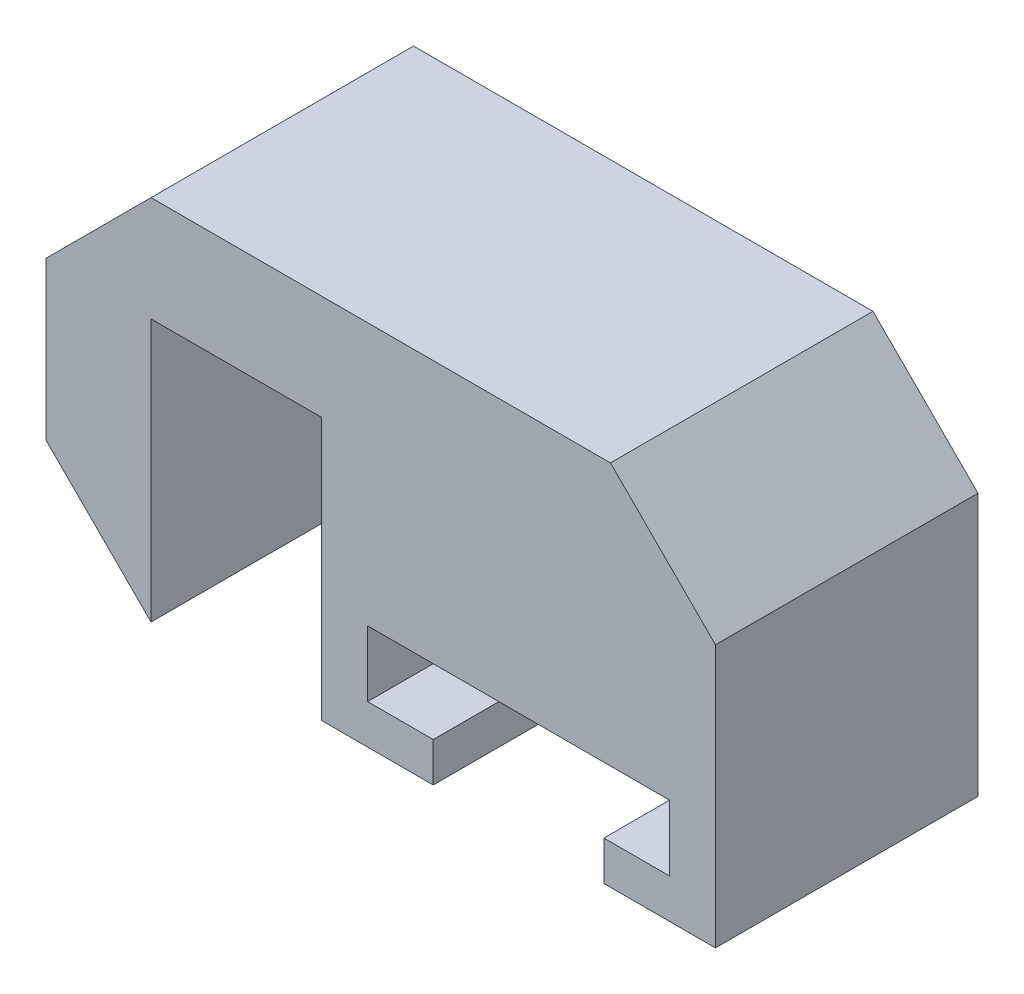
ISO-10303-21;
HEADER;
FILE_DESCRIPTION(('STEP AP214'),'2;1');
FILE_NAME('part.step','',(''),(''),'','','');
FILE_SCHEMA(('AUTOMOTIVE_DESIGN { 1 0 10303 214 1 1 1 1 }'));
ENDSEC;
DATA;
#1=APPLICATION_CONTEXT('core data for automotive mechanical design processes');
#2=APPLICATION_PROTOCOL_DEFINITION('international standard','automotive_design',2000,#1);
#3=PRODUCT_CONTEXT('',#1,'mechanical');
#4=PRODUCT('Part','Part','',(#3));
#5=PRODUCT_RELATED_PRODUCT_CATEGORY('part','',(#4));
#6=PRODUCT_DEFINITION_FORMATION('','',#4);
#7=PRODUCT_DEFINITION_CONTEXT('part definition',#1,'design');
#8=PRODUCT_DEFINITION('design','',#6,#7);
#9=PRODUCT_DEFINITION_SHAPE('','',#8);
#10=(LENGTH_UNIT() NAMED_UNIT(*) SI_UNIT(.MILLI.,.METRE.));
#11=(NAMED_UNIT(*) PLANE_ANGLE_UNIT() SI_UNIT($,.RADIAN.));
#12=(NAMED_UNIT(*) SI_UNIT($,.STERADIAN.) SOLID_ANGLE_UNIT());
#13=UNCERTAINTY_MEASURE_WITH_UNIT(LENGTH_MEASURE(1.E-05),#10,'distance_accuracy_value','');
#14=(GEOMETRIC_REPRESENTATION_CONTEXT(3) GLOBAL_UNCERTAINTY_ASSIGNED_CONTEXT((#13)) GLOBAL_UNIT_ASSIGNED_CONTEXT((#10,
#11,#12)) REPRESENTATION_CONTEXT('',''));
#15=CARTESIAN_POINT('',(0.,0.,0.));
#16=DIRECTION('',(0.,0.,1.));
#17=DIRECTION('',(1.,0.,0.));
#18=AXIS2_PLACEMENT_3D('',#15,#16,#17);
#19=CARTESIAN_POINT('',(0.,0.,10.));
#20=DIRECTION('',(0.,1.,0.));
#21=DIRECTION('',(0.,0.,1.));
#22=AXIS2_PLACEMENT_3D('',#19,#20,#21);
#23=PLANE('',#22);
#24=DIRECTION('',(1.,0.,0.));
#25=VECTOR('',#24,1.);
#26=CARTESIAN_POINT('',(0.,0.,0.));
#27=LINE('',#26,#25);
#28=CARTESIAN_POINT('',(0.,0.,0.));
#29=VERTEX_POINT('',#28);
#30=CARTESIAN_POINT('',(4.25,0.,0.));
#31=VERTEX_POINT('',#30);
#32=EDGE_CURVE('E195',#29,#31,#27,.T.);
#33=ORIENTED_EDGE('',*,*,#32,.T.);
#34=DIRECTION('',(0.,0.,1.));
#35=VECTOR('',#34,1.);
#36=CARTESIAN_POINT('',(4.25,0.,0.));
#37=LINE('',#36,#35);
#38=CARTESIAN_POINT('',(4.25,0.,10.));
#39=VERTEX_POINT('',#38);
#40=EDGE_CURVE('E202',#31,#39,#37,.T.);
#41=ORIENTED_EDGE('',*,*,#40,.T.);
#42=DIRECTION('',(1.,0.,0.));
#43=VECTOR('',#42,1.);
#44=CARTESIAN_POINT('',(0.,0.,10.));
#45=LINE('',#44,#43);
#46=CARTESIAN_POINT('',(0.,0.,10.));
#47=VERTEX_POINT('',#46);
#48=EDGE_CURVE('E286',#47,#39,#45,.T.);
#49=ORIENTED_EDGE('',*,*,#48,.F.);
#50=DIRECTION('',(0.,0.,-1.));
#51=VECTOR('',#50,1.);
#52=CARTESIAN_POINT('',(0.,0.,10.));
#53=LINE('',#52,#51);
#54=EDGE_CURVE('E238',#47,#29,#53,.T.);
#55=ORIENTED_EDGE('',*,*,#54,.T.);
#56=EDGE_LOOP('',(#33,#41,#49,#55));
#57=FACE_BOUND('',#56,.T.);
#58=ADVANCED_FACE('F41',(#57),#23,.F.);
#59=CARTESIAN_POINT('',(0.,10.,10.));
#60=DIRECTION('',(1.,0.,0.));
#61=DIRECTION('',(0.,0.,-1.));
#62=AXIS2_PLACEMENT_3D('',#59,#60,#61);
#63=PLANE('',#62);
#64=DIRECTION('',(0.,-1.,0.));
#65=VECTOR('',#64,1.);
#66=CARTESIAN_POINT('',(0.,10.,0.));
#67=LINE('',#66,#65);
#68=CARTESIAN_POINT('',(0.,10.,0.));
#69=VERTEX_POINT('',#68);
#70=EDGE_CURVE('E196',#69,#29,#67,.T.);
#71=ORIENTED_EDGE('',*,*,#70,.T.);
#72=ORIENTED_EDGE('',*,*,#54,.F.);
#73=DIRECTION('',(0.,-1.,0.));
#74=VECTOR('',#73,1.);
#75=CARTESIAN_POINT('',(0.,10.,10.));
#76=LINE('',#75,#74);
#77=CARTESIAN_POINT('',(0.,10.,10.));
#78=VERTEX_POINT('',#77);
#79=EDGE_CURVE('E221',#78,#47,#76,.T.);
#80=ORIENTED_EDGE('',*,*,#79,.F.);
#81=DIRECTION('',(0.,0.,-1.));
#82=VECTOR('',#81,1.);
#83=CARTESIAN_POINT('',(0.,10.,10.));
#84=LINE('',#83,#82);
#85=EDGE_CURVE('E222',#78,#69,#84,.T.);
#86=ORIENTED_EDGE('',*,*,#85,.T.);
#87=EDGE_LOOP('',(#71,#72,#80,#86));
#88=FACE_BOUND('',#87,.T.);
#89=ADVANCED_FACE('F395',(#88),#63,.F.);
#90=CARTESIAN_POINT('',(10.75,0.,10.));
#91=VERTEX_POINT('',#90);
#92=CARTESIAN_POINT('',(15.,0.,10.));
#93=VERTEX_POINT('',#92);
#94=EDGE_CURVE('E185',#91,#93,#45,.T.);
#95=ORIENTED_EDGE('',*,*,#94,.F.);
#96=DIRECTION('',(0.,0.,1.));
#97=VECTOR('',#96,1.);
#98=CARTESIAN_POINT('',(10.75,0.,0.));
#99=LINE('',#98,#97);
#100=CARTESIAN_POINT('',(10.75,0.,0.));
#101=VERTEX_POINT('',#100);
#102=EDGE_CURVE('E171',#101,#91,#99,.T.);
#103=ORIENTED_EDGE('',*,*,#102,.F.);
#104=CARTESIAN_POINT('',(15.,0.,0.));
#105=VERTEX_POINT('',#104);
#106=EDGE_CURVE('E183',#101,#105,#27,.T.);
#107=ORIENTED_EDGE('',*,*,#106,.T.);
#108=DIRECTION('',(0.,0.,-1.));
#109=VECTOR('',#108,1.);
#110=CARTESIAN_POINT('',(15.,0.,10.));
#111=LINE('',#110,#109);
#112=EDGE_CURVE('E235',#93,#105,#111,.T.);
#113=ORIENTED_EDGE('',*,*,#112,.F.);
#114=EDGE_LOOP('',(#95,#103,#107,#113));
#115=FACE_BOUND('',#114,.T.);
#116=ADVANCED_FACE('F181',(#115),#23,.F.);
#117=CARTESIAN_POINT('',(15.,0.,10.));
#118=DIRECTION('',(-1.,0.,0.));
#119=DIRECTION('',(0.,0.,1.));
#120=AXIS2_PLACEMENT_3D('',#117,#118,#119);
#121=PLANE('',#120);
#122=DIRECTION('',(0.,1.,0.));
#123=VECTOR('',#122,1.);
#124=CARTESIAN_POINT('',(15.,0.,0.));
#125=LINE('',#124,#123);
#126=CARTESIAN_POINT('',(15.,9.99999999999999,0.));
#127=VERTEX_POINT('',#126);
#128=EDGE_CURVE('E193',#105,#127,#125,.T.);
#129=ORIENTED_EDGE('',*,*,#128,.T.);
#130=DIRECTION('',(0.,0.,1.));
#131=VECTOR('',#130,1.);
#132=CARTESIAN_POINT('',(15.,9.99999999999999,10.));
#133=LINE('',#132,#131);
#134=CARTESIAN_POINT('',(15.,9.99999999999999,10.));
#135=VERTEX_POINT('',#134);
#136=EDGE_CURVE('E11',#127,#135,#133,.T.);
#137=ORIENTED_EDGE('',*,*,#136,.T.);
#138=DIRECTION('',(0.,1.,0.));
#139=VECTOR('',#138,1.);
#140=CARTESIAN_POINT('',(15.,0.,10.));
#141=LINE('',#140,#139);
#142=EDGE_CURVE('E282',#93,#135,#141,.T.);
#143=ORIENTED_EDGE('',*,*,#142,.F.);
#144=ORIENTED_EDGE('',*,*,#112,.T.);
#145=EDGE_LOOP('',(#129,#137,#143,#144));
#146=FACE_BOUND('',#145,.T.);
#147=ADVANCED_FACE('F404',(#146),#121,.F.);
#148=CARTESIAN_POINT('',(15.,14.,10.));
#149=DIRECTION('',(0.,-1.,0.));
#150=DIRECTION('',(1.,0.,0.));
#151=AXIS2_PLACEMENT_3D('',#148,#149,#150);
#152=PLANE('',#151);
#153=DIRECTION('',(-1.,0.,0.));
#154=VECTOR('',#153,1.);
#155=CARTESIAN_POINT('',(15.,14.,0.));
#156=LINE('',#155,#154);
#157=CARTESIAN_POINT('',(11.,14.,0.));
#158=VERTEX_POINT('',#157);
#159=CARTESIAN_POINT('',(-6.49999999999998,14.,0.));
#160=VERTEX_POINT('',#159);
#161=EDGE_CURVE('E208',#158,#160,#156,.T.);
#162=ORIENTED_EDGE('',*,*,#161,.T.);
#163=DIRECTION('',(0.,0.,1.));
#164=VECTOR('',#163,1.);
#165=CARTESIAN_POINT('',(-6.49999999999998,14.,10.));
#166=LINE('',#165,#164);
#167=CARTESIAN_POINT('',(-6.49999999999998,14.,10.));
#168=VERTEX_POINT('',#167);
#169=EDGE_CURVE('E51',#160,#168,#166,.T.);
#170=ORIENTED_EDGE('',*,*,#169,.T.);
#171=DIRECTION('',(-1.,0.,0.));
#172=VECTOR('',#171,1.);
#173=CARTESIAN_POINT('',(15.,14.,10.));
#174=LINE('',#173,#172);
#175=CARTESIAN_POINT('',(11.,14.,10.));
#176=VERTEX_POINT('',#175);
#177=EDGE_CURVE('E279',#176,#168,#174,.T.);
#178=ORIENTED_EDGE('',*,*,#177,.F.);
#179=DIRECTION('',(0.,0.,-1.));
#180=VECTOR('',#179,1.);
#181=CARTESIAN_POINT('',(11.,14.,10.));
#182=LINE('',#181,#180);
#183=EDGE_CURVE('E267',#176,#158,#182,.T.);
#184=ORIENTED_EDGE('',*,*,#183,.T.);
#185=EDGE_LOOP('',(#162,#170,#178,#184));
#186=FACE_BOUND('',#185,.T.);
#187=ADVANCED_FACE('F408',(#186),#152,.F.);
#188=CARTESIAN_POINT('',(-10.5,14.,10.));
#189=DIRECTION('',(1.,0.,0.));
#190=DIRECTION('',(0.,1.,0.));
#191=AXIS2_PLACEMENT_3D('',#188,#189,#190);
#192=PLANE('',#191);
#193=DIRECTION('',(0.,-1.,0.));
#194=VECTOR('',#193,1.);
#195=CARTESIAN_POINT('',(-10.5,14.,0.));
#196=LINE('',#195,#194);
#197=CARTESIAN_POINT('',(-10.5,9.99999999999999,0.));
#198=VERTEX_POINT('',#197);
#199=CARTESIAN_POINT('',(-10.5,4.00000000000001,0.));
#200=VERTEX_POINT('',#199);
#201=EDGE_CURVE('E211',#198,#200,#196,.T.);
#202=ORIENTED_EDGE('',*,*,#201,.T.);
#203=DIRECTION('',(0.,0.,1.));
#204=VECTOR('',#203,1.);
#205=CARTESIAN_POINT('',(-10.5,4.00000000000001,10.));
#206=LINE('',#205,#204);
#207=CARTESIAN_POINT('',(-10.5,4.00000000000001,10.));
#208=VERTEX_POINT('',#207);
#209=EDGE_CURVE('E255',#200,#208,#206,.T.);
#210=ORIENTED_EDGE('',*,*,#209,.T.);
#211=DIRECTION('',(0.,-1.,0.));
#212=VECTOR('',#211,1.);
#213=CARTESIAN_POINT('',(-10.5,14.,10.));
#214=LINE('',#213,#212);
#215=CARTESIAN_POINT('',(-10.5,9.99999999999999,10.));
#216=VERTEX_POINT('',#215);
#217=EDGE_CURVE('E275',#216,#208,#214,.T.);
#218=ORIENTED_EDGE('',*,*,#217,.F.);
#219=DIRECTION('',(0.,0.,-1.));
#220=VECTOR('',#219,1.);
#221=CARTESIAN_POINT('',(-10.5,9.99999999999999,10.));
#222=LINE('',#221,#220);
#223=EDGE_CURVE('E251',#216,#198,#222,.T.);
#224=ORIENTED_EDGE('',*,*,#223,.T.);
#225=EDGE_LOOP('',(#202,#210,#218,#224));
#226=FACE_BOUND('',#225,.T.);
#227=ADVANCED_FACE('F413',(#226),#192,.F.);
#228=CARTESIAN_POINT('',(-6.5,0.,10.));
#229=DIRECTION('',(-1.,0.,0.));
#230=DIRECTION('',(0.,-1.,0.));
#231=AXIS2_PLACEMENT_3D('',#228,#229,#230);
#232=PLANE('',#231);
#233=DIRECTION('',(0.,1.,0.));
#234=VECTOR('',#233,1.);
#235=CARTESIAN_POINT('',(-6.5,0.,0.));
#236=LINE('',#235,#234);
#237=CARTESIAN_POINT('',(-6.5,0.,0.));
#238=VERTEX_POINT('',#237);
#239=CARTESIAN_POINT('',(-6.5,10.,0.));
#240=VERTEX_POINT('',#239);
#241=EDGE_CURVE('E215',#238,#240,#236,.T.);
#242=ORIENTED_EDGE('',*,*,#241,.T.);
#243=DIRECTION('',(0.,0.,-1.));
#244=VECTOR('',#243,1.);
#245=CARTESIAN_POINT('',(-6.5,10.,10.));
#246=LINE('',#245,#244);
#247=CARTESIAN_POINT('',(-6.5,10.,10.));
#248=VERTEX_POINT('',#247);
#249=EDGE_CURVE('E226',#248,#240,#246,.T.);
#250=ORIENTED_EDGE('',*,*,#249,.F.);
#251=DIRECTION('',(0.,1.,0.));
#252=VECTOR('',#251,1.);
#253=CARTESIAN_POINT('',(-6.5,0.,10.));
#254=LINE('',#253,#252);
#255=CARTESIAN_POINT('',(-6.5,0.,10.));
#256=VERTEX_POINT('',#255);
#257=EDGE_CURVE('E273',#256,#248,#254,.T.);
#258=ORIENTED_EDGE('',*,*,#257,.F.);
#259=DIRECTION('',(0.,0.,-1.));
#260=VECTOR('',#259,1.);
#261=CARTESIAN_POINT('',(-6.5,0.,10.));
#262=LINE('',#261,#260);
#263=EDGE_CURVE('E231',#256,#238,#262,.T.);
#264=ORIENTED_EDGE('',*,*,#263,.T.);
#265=EDGE_LOOP('',(#242,#250,#258,#264));
#266=FACE_BOUND('',#265,.T.);
#267=ADVANCED_FACE('F418',(#266),#232,.F.);
#268=CARTESIAN_POINT('',(-6.5,10.,10.));
#269=DIRECTION('',(0.,1.,0.));
#270=DIRECTION('',(0.,0.,1.));
#271=AXIS2_PLACEMENT_3D('',#268,#269,#270);
#272=PLANE('',#271);
#273=DIRECTION('',(1.,0.,0.));
#274=VECTOR('',#273,1.);
#275=CARTESIAN_POINT('',(-6.5,10.,0.));
#276=LINE('',#275,#274);
#277=EDGE_CURVE('E218',#240,#69,#276,.T.);
#278=ORIENTED_EDGE('',*,*,#277,.T.);
#279=ORIENTED_EDGE('',*,*,#85,.F.);
#280=DIRECTION('',(1.,0.,0.));
#281=VECTOR('',#280,1.);
#282=CARTESIAN_POINT('',(-6.5,10.,10.));
#283=LINE('',#282,#281);
#284=EDGE_CURVE('E227',#248,#78,#283,.T.);
#285=ORIENTED_EDGE('',*,*,#284,.F.);
#286=ORIENTED_EDGE('',*,*,#249,.T.);
#287=EDGE_LOOP('',(#278,#279,#285,#286));
#288=FACE_BOUND('',#287,.T.);
#289=ADVANCED_FACE('F422',(#288),#272,.F.);
#290=CARTESIAN_POINT('',(0.,0.,10.));
#291=DIRECTION('',(0.,0.,1.));
#292=DIRECTION('',(1.,0.,0.));
#293=AXIS2_PLACEMENT_3D('',#290,#291,#292);
#294=PLANE('',#293);
#295=DIRECTION('',(0.,-1.,0.));
#296=VECTOR('',#295,1.);
#297=CARTESIAN_POINT('',(4.25,0.,10.));
#298=LINE('',#297,#296);
#299=CARTESIAN_POINT('',(4.25,1.5,10.));
#300=VERTEX_POINT('',#299);
#301=EDGE_CURVE('E177',#300,#39,#298,.T.);
#302=ORIENTED_EDGE('',*,*,#301,.F.);
#303=DIRECTION('',(1.,0.,0.));
#304=VECTOR('',#303,1.);
#305=CARTESIAN_POINT('',(4.25,1.5,10.));
#306=LINE('',#305,#304);
#307=CARTESIAN_POINT('',(1.75,1.5,10.));
#308=VERTEX_POINT('',#307);
#309=EDGE_CURVE('E320',#308,#300,#306,.T.);
#310=ORIENTED_EDGE('',*,*,#309,.F.);
#311=DIRECTION('',(0.,-1.,0.));
#312=VECTOR('',#311,1.);
#313=CARTESIAN_POINT('',(1.75,1.5,10.));
#314=LINE('',#313,#312);
#315=CARTESIAN_POINT('',(1.75,4.,10.));
#316=VERTEX_POINT('',#315);
#317=EDGE_CURVE('E324',#316,#308,#314,.T.);
#318=ORIENTED_EDGE('',*,*,#317,.F.);
#319=DIRECTION('',(-1.,0.,0.));
#320=VECTOR('',#319,1.);
#321=CARTESIAN_POINT('',(1.75,4.,10.));
#322=LINE('',#321,#320);
#323=CARTESIAN_POINT('',(13.25,4.,10.));
#324=VERTEX_POINT('',#323);
#325=EDGE_CURVE('E328',#324,#316,#322,.T.);
#326=ORIENTED_EDGE('',*,*,#325,.F.);
#327=DIRECTION('',(0.,1.,0.));
#328=VECTOR('',#327,1.);
#329=CARTESIAN_POINT('',(13.25,4.,10.));
#330=LINE('',#329,#328);
#331=CARTESIAN_POINT('',(13.25,1.5,10.));
#332=VERTEX_POINT('',#331);
#333=EDGE_CURVE('E332',#332,#324,#330,.T.);
#334=ORIENTED_EDGE('',*,*,#333,.F.);
#335=DIRECTION('',(1.,0.,0.));
#336=VECTOR('',#335,1.);
#337=CARTESIAN_POINT('',(13.25,1.5,10.));
#338=LINE('',#337,#336);
#339=CARTESIAN_POINT('',(10.75,1.5,10.));
#340=VERTEX_POINT('',#339);
#341=EDGE_CURVE('E336',#340,#332,#338,.T.);
#342=ORIENTED_EDGE('',*,*,#341,.F.);
#343=DIRECTION('',(0.,1.,0.));
#344=VECTOR('',#343,1.);
#345=CARTESIAN_POINT('',(10.75,1.5,10.));
#346=LINE('',#345,#344);
#347=EDGE_CURVE('E340',#91,#340,#346,.T.);
#348=ORIENTED_EDGE('',*,*,#347,.F.);
#349=ORIENTED_EDGE('',*,*,#94,.T.);
#350=ORIENTED_EDGE('',*,*,#142,.T.);
#351=DIRECTION('',(0.707106781186547,-0.707106781186549,0.));
#352=VECTOR('',#351,1.);
#353=CARTESIAN_POINT('',(12.5,12.5,10.));
#354=LINE('',#353,#352);
#355=EDGE_CURVE('E258',#135,#176,#354,.F.);
#356=ORIENTED_EDGE('',*,*,#355,.T.);
#357=ORIENTED_EDGE('',*,*,#177,.T.);
#358=DIRECTION('',(0.707106781186549,0.707106781186546,0.));
#359=VECTOR('',#358,1.);
#360=CARTESIAN_POINT('',(-10.25,10.25,10.));
#361=LINE('',#360,#359);
#362=EDGE_CURVE('E261',#168,#216,#361,.F.);
#363=ORIENTED_EDGE('',*,*,#362,.T.);
#364=ORIENTED_EDGE('',*,*,#217,.T.);
#365=DIRECTION('',(-0.707106781186547,0.707106781186549,0.));
#366=VECTOR('',#365,1.);
#367=CARTESIAN_POINT('',(-3.25000000000001,-3.25,10.));
#368=LINE('',#367,#366);
#369=EDGE_CURVE('E264',#208,#256,#368,.F.);
#370=ORIENTED_EDGE('',*,*,#369,.T.);
#371=ORIENTED_EDGE('',*,*,#257,.T.);
#372=ORIENTED_EDGE('',*,*,#284,.T.);
#373=ORIENTED_EDGE('',*,*,#79,.T.);
#374=ORIENTED_EDGE('',*,*,#48,.T.);
#375=EDGE_LOOP('',(#302,#310,#318,#326,#334,#342,#348,#349,#350,#356,#357,#363,#364,#370,#371,
#372,#373,#374));
#376=FACE_BOUND('',#375,.T.);
#377=ADVANCED_FACE('F383',(#376),#294,.T.);
#378=CARTESIAN_POINT('',(0.,0.,0.));
#379=DIRECTION('',(0.,0.,1.));
#380=DIRECTION('',(1.,0.,0.));
#381=AXIS2_PLACEMENT_3D('',#378,#379,#380);
#382=PLANE('',#381);
#383=DIRECTION('',(1.,0.,0.));
#384=VECTOR('',#383,1.);
#385=CARTESIAN_POINT('',(4.25,1.5,0.));
#386=LINE('',#385,#384);
#387=CARTESIAN_POINT('',(1.75,1.5,0.));
#388=VERTEX_POINT('',#387);
#389=CARTESIAN_POINT('',(4.25,1.5,0.));
#390=VERTEX_POINT('',#389);
#391=EDGE_CURVE('E346',#388,#390,#386,.T.);
#392=ORIENTED_EDGE('',*,*,#391,.T.);
#393=DIRECTION('',(0.,-1.,0.));
#394=VECTOR('',#393,1.);
#395=CARTESIAN_POINT('',(4.25,0.,0.));
#396=LINE('',#395,#394);
#397=EDGE_CURVE('E187',#390,#31,#396,.T.);
#398=ORIENTED_EDGE('',*,*,#397,.T.);
#399=ORIENTED_EDGE('',*,*,#32,.F.);
#400=ORIENTED_EDGE('',*,*,#70,.F.);
#401=ORIENTED_EDGE('',*,*,#277,.F.);
#402=ORIENTED_EDGE('',*,*,#241,.F.);
#403=DIRECTION('',(0.707106781186547,-0.707106781186549,0.));
#404=VECTOR('',#403,1.);
#405=CARTESIAN_POINT('',(-6.5,0.,0.));
#406=LINE('',#405,#404);
#407=EDGE_CURVE('E248',#238,#200,#406,.F.);
#408=ORIENTED_EDGE('',*,*,#407,.T.);
#409=ORIENTED_EDGE('',*,*,#201,.F.);
#410=DIRECTION('',(-0.707106781186549,-0.707106781186546,0.));
#411=VECTOR('',#410,1.);
#412=CARTESIAN_POINT('',(-10.5,9.99999999999999,0.));
#413=LINE('',#412,#411);
#414=EDGE_CURVE('E245',#198,#160,#413,.F.);
#415=ORIENTED_EDGE('',*,*,#414,.T.);
#416=ORIENTED_EDGE('',*,*,#161,.F.);
#417=DIRECTION('',(-0.707106781186547,0.707106781186549,0.));
#418=VECTOR('',#417,1.);
#419=CARTESIAN_POINT('',(11.,14.,0.));
#420=LINE('',#419,#418);
#421=EDGE_CURVE('E242',#158,#127,#420,.F.);
#422=ORIENTED_EDGE('',*,*,#421,.T.);
#423=ORIENTED_EDGE('',*,*,#128,.F.);
#424=ORIENTED_EDGE('',*,*,#106,.F.);
#425=DIRECTION('',(0.,1.,0.));
#426=VECTOR('',#425,1.);
#427=CARTESIAN_POINT('',(10.75,1.5,0.));
#428=LINE('',#427,#426);
#429=CARTESIAN_POINT('',(10.75,1.5,0.));
#430=VERTEX_POINT('',#429);
#431=EDGE_CURVE('E167',#101,#430,#428,.T.);
#432=ORIENTED_EDGE('',*,*,#431,.T.);
#433=DIRECTION('',(1.,0.,0.));
#434=VECTOR('',#433,1.);
#435=CARTESIAN_POINT('',(13.25,1.5,0.));
#436=LINE('',#435,#434);
#437=CARTESIAN_POINT('',(13.25,1.5,0.));
#438=VERTEX_POINT('',#437);
#439=EDGE_CURVE('E58',#430,#438,#436,.T.);
#440=ORIENTED_EDGE('',*,*,#439,.T.);
#441=DIRECTION('',(0.,1.,0.));
#442=VECTOR('',#441,1.);
#443=CARTESIAN_POINT('',(13.25,4.,0.));
#444=LINE('',#443,#442);
#445=CARTESIAN_POINT('',(13.25,4.,0.));
#446=VERTEX_POINT('',#445);
#447=EDGE_CURVE('E357',#438,#446,#444,.T.);
#448=ORIENTED_EDGE('',*,*,#447,.T.);
#449=DIRECTION('',(-1.,0.,0.));
#450=VECTOR('',#449,1.);
#451=CARTESIAN_POINT('',(1.75,4.,0.));
#452=LINE('',#451,#450);
#453=CARTESIAN_POINT('',(1.75,4.,0.));
#454=VERTEX_POINT('',#453);
#455=EDGE_CURVE('E353',#446,#454,#452,.T.);
#456=ORIENTED_EDGE('',*,*,#455,.T.);
#457=DIRECTION('',(0.,-1.,0.));
#458=VECTOR('',#457,1.);
#459=CARTESIAN_POINT('',(1.75,1.5,0.));
#460=LINE('',#459,#458);
#461=EDGE_CURVE('E349',#454,#388,#460,.T.);
#462=ORIENTED_EDGE('',*,*,#461,.T.);
#463=EDGE_LOOP('',(#392,#398,#399,#400,#401,#402,#408,#409,#415,#416,#422,#423,#424,#432,#440,
#448,#456,#462));
#464=FACE_BOUND('',#463,.T.);
#465=ADVANCED_FACE('F191',(#464),#382,.F.);
#466=CARTESIAN_POINT('',(-6.5,0.,10.));
#467=DIRECTION('',(0.707106781186548,0.707106781186546,0.));
#468=DIRECTION('',(0.,0.,-1.));
#469=AXIS2_PLACEMENT_3D('',#466,#467,#468);
#470=PLANE('',#469);
#471=ORIENTED_EDGE('',*,*,#369,.F.);
#472=ORIENTED_EDGE('',*,*,#209,.F.);
#473=ORIENTED_EDGE('',*,*,#407,.F.);
#474=ORIENTED_EDGE('',*,*,#263,.F.);
#475=EDGE_LOOP('',(#471,#472,#473,#474));
#476=FACE_BOUND('',#475,.T.);
#477=ADVANCED_FACE('F429',(#476),#470,.F.);
#478=CARTESIAN_POINT('',(-10.5,9.99999999999999,10.));
#479=DIRECTION('',(0.707106781186546,-0.707106781186549,0.));
#480=DIRECTION('',(0.,0.,-1.));
#481=AXIS2_PLACEMENT_3D('',#478,#479,#480);
#482=PLANE('',#481);
#483=ORIENTED_EDGE('',*,*,#362,.F.);
#484=ORIENTED_EDGE('',*,*,#169,.F.);
#485=ORIENTED_EDGE('',*,*,#414,.F.);
#486=ORIENTED_EDGE('',*,*,#223,.F.);
#487=EDGE_LOOP('',(#483,#484,#485,#486));
#488=FACE_BOUND('',#487,.T.);
#489=ADVANCED_FACE('F446',(#488),#482,.F.);
#490=CARTESIAN_POINT('',(11.,14.,10.));
#491=DIRECTION('',(-0.707106781186549,-0.707106781186547,0.));
#492=DIRECTION('',(0.,0.,-1.));
#493=AXIS2_PLACEMENT_3D('',#490,#491,#492);
#494=PLANE('',#493);
#495=ORIENTED_EDGE('',*,*,#355,.F.);
#496=ORIENTED_EDGE('',*,*,#136,.F.);
#497=ORIENTED_EDGE('',*,*,#421,.F.);
#498=ORIENTED_EDGE('',*,*,#183,.F.);
#499=EDGE_LOOP('',(#495,#496,#497,#498));
#500=FACE_BOUND('',#499,.T.);
#501=ADVANCED_FACE('F44',(#500),#494,.F.);
#502=CARTESIAN_POINT('',(4.25,0.,0.));
#503=DIRECTION('',(-1.,0.,0.));
#504=DIRECTION('',(0.,-1.,0.));
#505=AXIS2_PLACEMENT_3D('',#502,#503,#504);
#506=PLANE('',#505);
#507=ORIENTED_EDGE('',*,*,#301,.T.);
#508=ORIENTED_EDGE('',*,*,#40,.F.);
#509=ORIENTED_EDGE('',*,*,#397,.F.);
#510=DIRECTION('',(0.,0.,1.));
#511=VECTOR('',#510,1.);
#512=CARTESIAN_POINT('',(4.25,1.5,0.));
#513=LINE('',#512,#511);
#514=EDGE_CURVE('E312',#390,#300,#513,.T.);
#515=ORIENTED_EDGE('',*,*,#514,.T.);
#516=EDGE_LOOP('',(#507,#508,#509,#515));
#517=FACE_BOUND('',#516,.T.);
#518=ADVANCED_FACE('F381',(#517),#506,.F.);
#519=CARTESIAN_POINT('',(4.25,1.5,0.));
#520=DIRECTION('',(0.,-1.,0.));
#521=DIRECTION('',(1.,0.,0.));
#522=AXIS2_PLACEMENT_3D('',#519,#520,#521);
#523=PLANE('',#522);
#524=ORIENTED_EDGE('',*,*,#309,.T.);
#525=ORIENTED_EDGE('',*,*,#514,.F.);
#526=ORIENTED_EDGE('',*,*,#391,.F.);
#527=DIRECTION('',(0.,0.,1.));
#528=VECTOR('',#527,1.);
#529=CARTESIAN_POINT('',(1.75,1.5,0.));
#530=LINE('',#529,#528);
#531=EDGE_CURVE('E309',#388,#308,#530,.T.);
#532=ORIENTED_EDGE('',*,*,#531,.T.);
#533=EDGE_LOOP('',(#524,#525,#526,#532));
#534=FACE_BOUND('',#533,.T.);
#535=ADVANCED_FACE('F377',(#534),#523,.F.);
#536=CARTESIAN_POINT('',(1.75,1.5,0.));
#537=DIRECTION('',(-1.,0.,0.));
#538=DIRECTION('',(0.,0.,1.));
#539=AXIS2_PLACEMENT_3D('',#536,#537,#538);
#540=PLANE('',#539);
#541=ORIENTED_EDGE('',*,*,#317,.T.);
#542=ORIENTED_EDGE('',*,*,#531,.F.);
#543=ORIENTED_EDGE('',*,*,#461,.F.);
#544=DIRECTION('',(0.,0.,1.));
#545=VECTOR('',#544,1.);
#546=CARTESIAN_POINT('',(1.75,4.,0.));
#547=LINE('',#546,#545);
#548=EDGE_CURVE('E306',#454,#316,#547,.T.);
#549=ORIENTED_EDGE('',*,*,#548,.T.);
#550=EDGE_LOOP('',(#541,#542,#543,#549));
#551=FACE_BOUND('',#550,.T.);
#552=ADVANCED_FACE('F373',(#551),#540,.F.);
#553=CARTESIAN_POINT('',(1.75,4.,0.));
#554=DIRECTION('',(0.,1.,0.));
#555=DIRECTION('',(-1.,0.,0.));
#556=AXIS2_PLACEMENT_3D('',#553,#554,#555);
#557=PLANE('',#556);
#558=ORIENTED_EDGE('',*,*,#325,.T.);
#559=ORIENTED_EDGE('',*,*,#548,.F.);
#560=ORIENTED_EDGE('',*,*,#455,.F.);
#561=DIRECTION('',(0.,0.,1.));
#562=VECTOR('',#561,1.);
#563=CARTESIAN_POINT('',(13.25,4.,0.));
#564=LINE('',#563,#562);
#565=EDGE_CURVE('E303',#446,#324,#564,.T.);
#566=ORIENTED_EDGE('',*,*,#565,.T.);
#567=EDGE_LOOP('',(#558,#559,#560,#566));
#568=FACE_BOUND('',#567,.T.);
#569=ADVANCED_FACE('F369',(#568),#557,.F.);
#570=CARTESIAN_POINT('',(13.25,4.,0.));
#571=DIRECTION('',(1.,0.,0.));
#572=DIRECTION('',(0.,0.,-1.));
#573=AXIS2_PLACEMENT_3D('',#570,#571,#572);
#574=PLANE('',#573);
#575=ORIENTED_EDGE('',*,*,#333,.T.);
#576=ORIENTED_EDGE('',*,*,#565,.F.);
#577=ORIENTED_EDGE('',*,*,#447,.F.);
#578=DIRECTION('',(0.,0.,1.));
#579=VECTOR('',#578,1.);
#580=CARTESIAN_POINT('',(13.25,1.5,0.));
#581=LINE('',#580,#579);
#582=EDGE_CURVE('E300',#438,#332,#581,.T.);
#583=ORIENTED_EDGE('',*,*,#582,.T.);
#584=EDGE_LOOP('',(#575,#576,#577,#583));
#585=FACE_BOUND('',#584,.T.);
#586=ADVANCED_FACE('F365',(#585),#574,.F.);
#587=CARTESIAN_POINT('',(13.25,1.5,0.));
#588=DIRECTION('',(0.,-1.,0.));
#589=DIRECTION('',(0.,0.,-1.));
#590=AXIS2_PLACEMENT_3D('',#587,#588,#589);
#591=PLANE('',#590);
#592=ORIENTED_EDGE('',*,*,#341,.T.);
#593=ORIENTED_EDGE('',*,*,#582,.F.);
#594=ORIENTED_EDGE('',*,*,#439,.F.);
#595=DIRECTION('',(0.,0.,1.));
#596=VECTOR('',#595,1.);
#597=CARTESIAN_POINT('',(10.75,1.5,0.));
#598=LINE('',#597,#596);
#599=EDGE_CURVE('E173',#430,#340,#598,.T.);
#600=ORIENTED_EDGE('',*,*,#599,.T.);
#601=EDGE_LOOP('',(#592,#593,#594,#600));
#602=FACE_BOUND('',#601,.T.);
#603=ADVANCED_FACE('F385',(#602),#591,.F.);
#604=CARTESIAN_POINT('',(10.75,1.5,0.));
#605=DIRECTION('',(1.,0.,0.));
#606=DIRECTION('',(0.,1.,0.));
#607=AXIS2_PLACEMENT_3D('',#604,#605,#606);
#608=PLANE('',#607);
#609=ORIENTED_EDGE('',*,*,#347,.T.);
#610=ORIENTED_EDGE('',*,*,#599,.F.);
#611=ORIENTED_EDGE('',*,*,#431,.F.);
#612=ORIENTED_EDGE('',*,*,#102,.T.);
#613=EDGE_LOOP('',(#609,#610,#611,#612));
#614=FACE_BOUND('',#613,.T.);
#615=ADVANCED_FACE('F170',(#614),#608,.F.);
#616=CLOSED_SHELL('',(#58,#89,#116,#147,#187,#227,#267,#289,#377,#465,#477,#489,#501,#518,#535,
#552,#569,#586,#603,#615));
#617=MANIFOLD_SOLID_BREP('B2',#616);
#618=ADVANCED_BREP_SHAPE_REPRESENTATION('',(#18,#617),#14);
#619=SHAPE_DEFINITION_REPRESENTATION(#9,#618);
ENDSEC;
END-ISO-10303-21;
